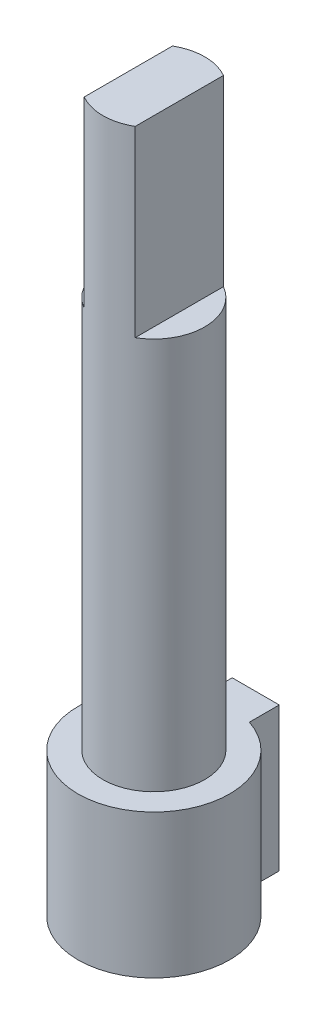
ISO-10303-21;
HEADER;
FILE_DESCRIPTION(('STEP AP214'),'2;1');
FILE_NAME('part.step','',(''),(''),'','','');
FILE_SCHEMA(('AUTOMOTIVE_DESIGN { 1 0 10303 214 1 1 1 1 }'));
ENDSEC;
DATA;
#1=APPLICATION_CONTEXT('core data for automotive mechanical design processes');
#2=APPLICATION_PROTOCOL_DEFINITION('international standard','automotive_design',2000,#1);
#3=PRODUCT_CONTEXT('',#1,'mechanical');
#4=PRODUCT('Part','Part','',(#3));
#5=PRODUCT_RELATED_PRODUCT_CATEGORY('part','',(#4));
#6=PRODUCT_DEFINITION_FORMATION('','',#4);
#7=PRODUCT_DEFINITION_CONTEXT('part definition',#1,'design');
#8=PRODUCT_DEFINITION('design','',#6,#7);
#9=PRODUCT_DEFINITION_SHAPE('','',#8);
#10=(LENGTH_UNIT() NAMED_UNIT(*) SI_UNIT(.MILLI.,.METRE.));
#11=(NAMED_UNIT(*) PLANE_ANGLE_UNIT() SI_UNIT($,.RADIAN.));
#12=(NAMED_UNIT(*) SI_UNIT($,.STERADIAN.) SOLID_ANGLE_UNIT());
#13=UNCERTAINTY_MEASURE_WITH_UNIT(LENGTH_MEASURE(1.E-05),#10,'distance_accuracy_value','');
#14=(GEOMETRIC_REPRESENTATION_CONTEXT(3) GLOBAL_UNCERTAINTY_ASSIGNED_CONTEXT((#13)) GLOBAL_UNIT_ASSIGNED_CONTEXT((#10,
#11,#12)) REPRESENTATION_CONTEXT('',''));
#15=CARTESIAN_POINT('',(0.,0.,0.));
#16=DIRECTION('',(0.,0.,1.));
#17=DIRECTION('',(1.,0.,0.));
#18=AXIS2_PLACEMENT_3D('',#15,#16,#17);
#19=CARTESIAN_POINT('',(0.,5.5,0.));
#20=DIRECTION('',(0.,1.,0.));
#21=DIRECTION('',(0.,0.,1.));
#22=AXIS2_PLACEMENT_3D('',#19,#20,#21);
#23=PLANE('',#22);
#24=CARTESIAN_POINT('',(0.,5.5,0.));
#25=DIRECTION('',(0.,1.,0.));
#26=DIRECTION('',(0.,0.,1.));
#27=AXIS2_PLACEMENT_3D('',#24,#25,#26);
#28=CIRCLE('',#27,1.95);
#29=CARTESIAN_POINT('',(0.,5.5,1.95));
#30=VERTEX_POINT('',#29);
#31=EDGE_CURVE('E176',#30,#30,#28,.T.);
#32=ORIENTED_EDGE('',*,*,#31,.F.);
#33=EDGE_LOOP('',(#32));
#34=FACE_BOUND('',#33,.T.);
#35=DIRECTION('',(0.,0.,1.));
#36=VECTOR('',#35,1.);
#37=CARTESIAN_POINT('',(-0.9,5.5,0.));
#38=LINE('',#37,#36);
#39=CARTESIAN_POINT('',(-0.9,5.50000000000001,-3.89842712474619));
#40=VERTEX_POINT('',#39);
#41=CARTESIAN_POINT('',(-0.9,5.5,-2.75680975041804));
#42=VERTEX_POINT('',#41);
#43=EDGE_CURVE('E180',#40,#42,#38,.T.);
#44=ORIENTED_EDGE('',*,*,#43,.T.);
#45=CARTESIAN_POINT('',(0.,5.50000000000001,0.));
#46=DIRECTION('',(0.,1.,0.));
#47=DIRECTION('',(0.,0.,1.));
#48=AXIS2_PLACEMENT_3D('',#45,#46,#47);
#49=CIRCLE('',#48,2.9);
#50=CARTESIAN_POINT('',(0.9,5.50000000000001,-2.75680975041804));
#51=VERTEX_POINT('',#50);
#52=EDGE_CURVE('E11',#42,#51,#49,.T.);
#53=ORIENTED_EDGE('',*,*,#52,.T.);
#54=DIRECTION('',(0.,0.,-1.));
#55=VECTOR('',#54,1.);
#56=CARTESIAN_POINT('',(0.9,5.5,0.));
#57=LINE('',#56,#55);
#58=CARTESIAN_POINT('',(0.9,5.50000000000001,-3.89842712474619));
#59=VERTEX_POINT('',#58);
#60=EDGE_CURVE('E50',#51,#59,#57,.T.);
#61=ORIENTED_EDGE('',*,*,#60,.T.);
#62=DIRECTION('',(-1.,0.,0.));
#63=VECTOR('',#62,1.);
#64=CARTESIAN_POINT('',(0.,5.5,-3.89842712474619));
#65=LINE('',#64,#63);
#66=EDGE_CURVE('E110',#59,#40,#65,.T.);
#67=ORIENTED_EDGE('',*,*,#66,.T.);
#68=EDGE_LOOP('',(#44,#53,#61,#67));
#69=FACE_BOUND('',#68,.T.);
#70=ADVANCED_FACE('F41',(#34,#69),#23,.T.);
#71=CARTESIAN_POINT('',(0.,5.5,0.));
#72=DIRECTION('',(0.,1.,0.));
#73=DIRECTION('',(0.,0.,1.));
#74=AXIS2_PLACEMENT_3D('',#71,#72,#73);
#75=CYLINDRICAL_SURFACE('',#74,1.95);
#76=DIRECTION('',(0.,1.,0.));
#77=VECTOR('',#76,1.);
#78=CARTESIAN_POINT('',(-0.975,20.5,-1.68874953737966));
#79=LINE('',#78,#77);
#80=CARTESIAN_POINT('',(-0.975,20.5,-1.68874953737966));
#81=VERTEX_POINT('',#80);
#82=CARTESIAN_POINT('',(-0.975,27.5,-1.68874953737966));
#83=VERTEX_POINT('',#82);
#84=EDGE_CURVE('E154',#81,#83,#79,.T.);
#85=ORIENTED_EDGE('',*,*,#84,.T.);
#86=CARTESIAN_POINT('',(0.,27.5,0.));
#87=DIRECTION('',(0.,1.,0.));
#88=DIRECTION('',(0.,0.,1.));
#89=AXIS2_PLACEMENT_3D('',#86,#87,#88);
#90=CIRCLE('',#89,1.95);
#91=CARTESIAN_POINT('',(0.975,27.5,-1.68874953737966));
#92=VERTEX_POINT('',#91);
#93=EDGE_CURVE('E181',#92,#83,#90,.T.);
#94=ORIENTED_EDGE('',*,*,#93,.F.);
#95=DIRECTION('',(0.,1.,0.));
#96=VECTOR('',#95,1.);
#97=CARTESIAN_POINT('',(0.975,20.5,-1.68874953737966));
#98=LINE('',#97,#96);
#99=CARTESIAN_POINT('',(0.975,20.5,-1.68874953737966));
#100=VERTEX_POINT('',#99);
#101=EDGE_CURVE('E168',#100,#92,#98,.T.);
#102=ORIENTED_EDGE('',*,*,#101,.F.);
#103=CARTESIAN_POINT('',(0.,20.5,0.));
#104=DIRECTION('',(0.,1.,0.));
#105=DIRECTION('',(0.,0.,1.));
#106=AXIS2_PLACEMENT_3D('',#103,#104,#105);
#107=CIRCLE('',#106,1.95);
#108=CARTESIAN_POINT('',(0.975,20.5,1.68874953737966));
#109=VERTEX_POINT('',#108);
#110=EDGE_CURVE('E161',#109,#100,#107,.T.);
#111=ORIENTED_EDGE('',*,*,#110,.F.);
#112=DIRECTION('',(0.,1.,0.));
#113=VECTOR('',#112,1.);
#114=CARTESIAN_POINT('',(0.975,20.5,1.68874953737966));
#115=LINE('',#114,#113);
#116=CARTESIAN_POINT('',(0.975,27.5,1.68874953737966));
#117=VERTEX_POINT('',#116);
#118=EDGE_CURVE('E153',#109,#117,#115,.T.);
#119=ORIENTED_EDGE('',*,*,#118,.T.);
#120=CARTESIAN_POINT('',(-0.975,27.5,1.68874953737966));
#121=VERTEX_POINT('',#120);
#122=EDGE_CURVE('E158',#121,#117,#90,.T.);
#123=ORIENTED_EDGE('',*,*,#122,.F.);
#124=DIRECTION('',(0.,1.,0.));
#125=VECTOR('',#124,1.);
#126=CARTESIAN_POINT('',(-0.975,20.5,1.68874953737966));
#127=LINE('',#126,#125);
#128=CARTESIAN_POINT('',(-0.975,20.5,1.68874953737966));
#129=VERTEX_POINT('',#128);
#130=EDGE_CURVE('E150',#129,#121,#127,.T.);
#131=ORIENTED_EDGE('',*,*,#130,.F.);
#132=CARTESIAN_POINT('',(0.,20.5,0.));
#133=DIRECTION('',(0.,1.,0.));
#134=DIRECTION('',(0.,0.,1.));
#135=AXIS2_PLACEMENT_3D('',#132,#133,#134);
#136=CIRCLE('',#135,1.95);
#137=EDGE_CURVE('E142',#81,#129,#136,.T.);
#138=ORIENTED_EDGE('',*,*,#137,.F.);
#139=EDGE_LOOP('',(#85,#94,#102,#111,#119,#123,#131,#138));
#140=FACE_BOUND('',#139,.T.);
#141=ORIENTED_EDGE('',*,*,#31,.T.);
#142=EDGE_LOOP('',(#141));
#143=FACE_BOUND('',#142,.T.);
#144=ADVANCED_FACE('F204',(#140,#143),#75,.T.);
#145=CARTESIAN_POINT('',(0.,27.5,0.));
#146=DIRECTION('',(0.,1.,0.));
#147=DIRECTION('',(0.,0.,1.));
#148=AXIS2_PLACEMENT_3D('',#145,#146,#147);
#149=PLANE('',#148);
#150=DIRECTION('',(0.,0.,-1.));
#151=VECTOR('',#150,1.);
#152=CARTESIAN_POINT('',(-0.975,27.5,-1.68874953737966));
#153=LINE('',#152,#151);
#154=EDGE_CURVE('E146',#121,#83,#153,.T.);
#155=ORIENTED_EDGE('',*,*,#154,.F.);
#156=ORIENTED_EDGE('',*,*,#122,.T.);
#157=DIRECTION('',(0.,0.,1.));
#158=VECTOR('',#157,1.);
#159=CARTESIAN_POINT('',(0.975,27.5,-1.68874953737966));
#160=LINE('',#159,#158);
#161=EDGE_CURVE('E136',#92,#117,#160,.T.);
#162=ORIENTED_EDGE('',*,*,#161,.F.);
#163=ORIENTED_EDGE('',*,*,#93,.T.);
#164=EDGE_LOOP('',(#155,#156,#162,#163));
#165=FACE_BOUND('',#164,.T.);
#166=ADVANCED_FACE('F210',(#165),#149,.T.);
#167=CARTESIAN_POINT('',(0.975,20.5,-1.68874953737966));
#168=DIRECTION('',(-1.,0.,0.));
#169=DIRECTION('',(0.,0.,1.));
#170=AXIS2_PLACEMENT_3D('',#167,#168,#169);
#171=PLANE('',#170);
#172=ORIENTED_EDGE('',*,*,#161,.T.);
#173=ORIENTED_EDGE('',*,*,#118,.F.);
#174=DIRECTION('',(0.,0.,1.));
#175=VECTOR('',#174,1.);
#176=CARTESIAN_POINT('',(0.975,20.5,-1.68874953737966));
#177=LINE('',#176,#175);
#178=EDGE_CURVE('E164',#100,#109,#177,.T.);
#179=ORIENTED_EDGE('',*,*,#178,.F.);
#180=ORIENTED_EDGE('',*,*,#101,.T.);
#181=EDGE_LOOP('',(#172,#173,#179,#180));
#182=FACE_BOUND('',#181,.T.);
#183=ADVANCED_FACE('F216',(#182),#171,.F.);
#184=CARTESIAN_POINT('',(0.,20.5,0.));
#185=DIRECTION('',(0.,1.,0.));
#186=DIRECTION('',(0.,0.,1.));
#187=AXIS2_PLACEMENT_3D('',#184,#185,#186);
#188=PLANE('',#187);
#189=ORIENTED_EDGE('',*,*,#110,.T.);
#190=ORIENTED_EDGE('',*,*,#178,.T.);
#191=EDGE_LOOP('',(#189,#190));
#192=FACE_BOUND('',#191,.T.);
#193=ADVANCED_FACE('F221',(#192),#188,.T.);
#194=CARTESIAN_POINT('',(-0.975,20.5,-1.68874953737966));
#195=DIRECTION('',(1.,0.,0.));
#196=DIRECTION('',(0.,0.,-1.));
#197=AXIS2_PLACEMENT_3D('',#194,#195,#196);
#198=PLANE('',#197);
#199=ORIENTED_EDGE('',*,*,#154,.T.);
#200=ORIENTED_EDGE('',*,*,#84,.F.);
#201=DIRECTION('',(0.,0.,-1.));
#202=VECTOR('',#201,1.);
#203=CARTESIAN_POINT('',(-0.975,20.5,-1.68874953737966));
#204=LINE('',#203,#202);
#205=EDGE_CURVE('E145',#129,#81,#204,.T.);
#206=ORIENTED_EDGE('',*,*,#205,.F.);
#207=ORIENTED_EDGE('',*,*,#130,.T.);
#208=EDGE_LOOP('',(#199,#200,#206,#207));
#209=FACE_BOUND('',#208,.T.);
#210=ADVANCED_FACE('F237',(#209),#198,.F.);
#211=CARTESIAN_POINT('',(0.,20.5,0.));
#212=DIRECTION('',(0.,1.,0.));
#213=DIRECTION('',(0.,0.,1.));
#214=AXIS2_PLACEMENT_3D('',#211,#212,#213);
#215=PLANE('',#214);
#216=ORIENTED_EDGE('',*,*,#137,.T.);
#217=ORIENTED_EDGE('',*,*,#205,.T.);
#218=EDGE_LOOP('',(#216,#217));
#219=FACE_BOUND('',#218,.T.);
#220=ADVANCED_FACE('F242',(#219),#215,.T.);
#221=CARTESIAN_POINT('',(0.,100.,0.));
#222=DIRECTION('',(0.,-1.,0.));
#223=DIRECTION('',(0.,0.,-1.));
#224=AXIS2_PLACEMENT_3D('',#221,#222,#223);
#225=CYLINDRICAL_SURFACE('',#224,2.9);
#226=DIRECTION('',(0.,-1.,0.));
#227=VECTOR('',#226,1.);
#228=CARTESIAN_POINT('',(-0.9,100.,-2.75680975041804));
#229=LINE('',#228,#227);
#230=CARTESIAN_POINT('',(-0.9,0.,-2.75680975041804));
#231=VERTEX_POINT('',#230);
#232=EDGE_CURVE('E65',#42,#231,#229,.T.);
#233=ORIENTED_EDGE('',*,*,#232,.T.);
#234=CARTESIAN_POINT('',(0.,0.,0.));
#235=DIRECTION('',(0.,-1.,0.));
#236=DIRECTION('',(0.,0.,-1.));
#237=AXIS2_PLACEMENT_3D('',#234,#235,#236);
#238=CIRCLE('',#237,2.9);
#239=CARTESIAN_POINT('',(0.9,0.,-2.75680975041804));
#240=VERTEX_POINT('',#239);
#241=EDGE_CURVE('E131',#240,#231,#238,.T.);
#242=ORIENTED_EDGE('',*,*,#241,.F.);
#243=DIRECTION('',(0.,-1.,0.));
#244=VECTOR('',#243,1.);
#245=CARTESIAN_POINT('',(0.9,100.,-2.75680975041804));
#246=LINE('',#245,#244);
#247=EDGE_CURVE('E114',#51,#240,#246,.T.);
#248=ORIENTED_EDGE('',*,*,#247,.F.);
#249=ORIENTED_EDGE('',*,*,#52,.F.);
#250=EDGE_LOOP('',(#233,#242,#248,#249));
#251=FACE_BOUND('',#250,.T.);
#252=ADVANCED_FACE('F192',(#251),#225,.T.);
#253=CARTESIAN_POINT('',(0.9,100.,-2.75680975041804));
#254=DIRECTION('',(1.,0.,0.));
#255=DIRECTION('',(0.,0.,-1.));
#256=AXIS2_PLACEMENT_3D('',#253,#254,#255);
#257=PLANE('',#256);
#258=ORIENTED_EDGE('',*,*,#247,.T.);
#259=DIRECTION('',(0.,0.,1.));
#260=VECTOR('',#259,1.);
#261=CARTESIAN_POINT('',(0.9,0.,-2.75680975041804));
#262=LINE('',#261,#260);
#263=CARTESIAN_POINT('',(0.9,0.,-3.89842712474619));
#264=VERTEX_POINT('',#263);
#265=EDGE_CURVE('E118',#264,#240,#262,.T.);
#266=ORIENTED_EDGE('',*,*,#265,.F.);
#267=DIRECTION('',(0.,-1.,0.));
#268=VECTOR('',#267,1.);
#269=CARTESIAN_POINT('',(0.9,100.,-3.89842712474619));
#270=LINE('',#269,#268);
#271=EDGE_CURVE('E106',#59,#264,#270,.T.);
#272=ORIENTED_EDGE('',*,*,#271,.F.);
#273=ORIENTED_EDGE('',*,*,#60,.F.);
#274=EDGE_LOOP('',(#258,#266,#272,#273));
#275=FACE_BOUND('',#274,.T.);
#276=ADVANCED_FACE('F119',(#275),#257,.T.);
#277=CARTESIAN_POINT('',(-0.9,100.,-3.89842712474619));
#278=DIRECTION('',(0.,0.,-1.));
#279=DIRECTION('',(-1.,0.,0.));
#280=AXIS2_PLACEMENT_3D('',#277,#278,#279);
#281=PLANE('',#280);
#282=ORIENTED_EDGE('',*,*,#271,.T.);
#283=DIRECTION('',(1.,0.,0.));
#284=VECTOR('',#283,1.);
#285=CARTESIAN_POINT('',(-0.9,0.,-3.89842712474619));
#286=LINE('',#285,#284);
#287=CARTESIAN_POINT('',(-0.9,0.,-3.89842712474619));
#288=VERTEX_POINT('',#287);
#289=EDGE_CURVE('E57',#288,#264,#286,.T.);
#290=ORIENTED_EDGE('',*,*,#289,.F.);
#291=DIRECTION('',(0.,-1.,0.));
#292=VECTOR('',#291,1.);
#293=CARTESIAN_POINT('',(-0.9,100.,-3.89842712474619));
#294=LINE('',#293,#292);
#295=EDGE_CURVE('E115',#40,#288,#294,.T.);
#296=ORIENTED_EDGE('',*,*,#295,.F.);
#297=ORIENTED_EDGE('',*,*,#66,.F.);
#298=EDGE_LOOP('',(#282,#290,#296,#297));
#299=FACE_BOUND('',#298,.T.);
#300=ADVANCED_FACE('F108',(#299),#281,.T.);
#301=CARTESIAN_POINT('',(-0.9,100.,-2.75680975041804));
#302=DIRECTION('',(-1.,0.,0.));
#303=DIRECTION('',(0.,0.,1.));
#304=AXIS2_PLACEMENT_3D('',#301,#302,#303);
#305=PLANE('',#304);
#306=ORIENTED_EDGE('',*,*,#295,.T.);
#307=DIRECTION('',(0.,0.,-1.));
#308=VECTOR('',#307,1.);
#309=CARTESIAN_POINT('',(-0.9,0.,-2.75680975041804));
#310=LINE('',#309,#308);
#311=EDGE_CURVE('E127',#231,#288,#310,.T.);
#312=ORIENTED_EDGE('',*,*,#311,.F.);
#313=ORIENTED_EDGE('',*,*,#232,.F.);
#314=ORIENTED_EDGE('',*,*,#43,.F.);
#315=EDGE_LOOP('',(#306,#312,#313,#314));
#316=FACE_BOUND('',#315,.T.);
#317=ADVANCED_FACE('F194',(#316),#305,.T.);
#318=CARTESIAN_POINT('',(0.,0.,0.));
#319=DIRECTION('',(0.,1.,0.));
#320=DIRECTION('',(0.,0.,1.));
#321=AXIS2_PLACEMENT_3D('',#318,#319,#320);
#322=PLANE('',#321);
#323=ORIENTED_EDGE('',*,*,#241,.T.);
#324=ORIENTED_EDGE('',*,*,#311,.T.);
#325=ORIENTED_EDGE('',*,*,#289,.T.);
#326=ORIENTED_EDGE('',*,*,#265,.T.);
#327=EDGE_LOOP('',(#323,#324,#325,#326));
#328=FACE_BOUND('',#327,.T.);
#329=ADVANCED_FACE('F43',(#328),#322,.F.);
#330=CLOSED_SHELL('',(#70,#144,#166,#183,#193,#210,#220,#252,#276,#300,#317,#329));
#331=MANIFOLD_SOLID_BREP('B2',#330);
#332=ADVANCED_BREP_SHAPE_REPRESENTATION('',(#18,#331),#14);
#333=SHAPE_DEFINITION_REPRESENTATION(#9,#332);
ENDSEC;
END-ISO-10303-21;
